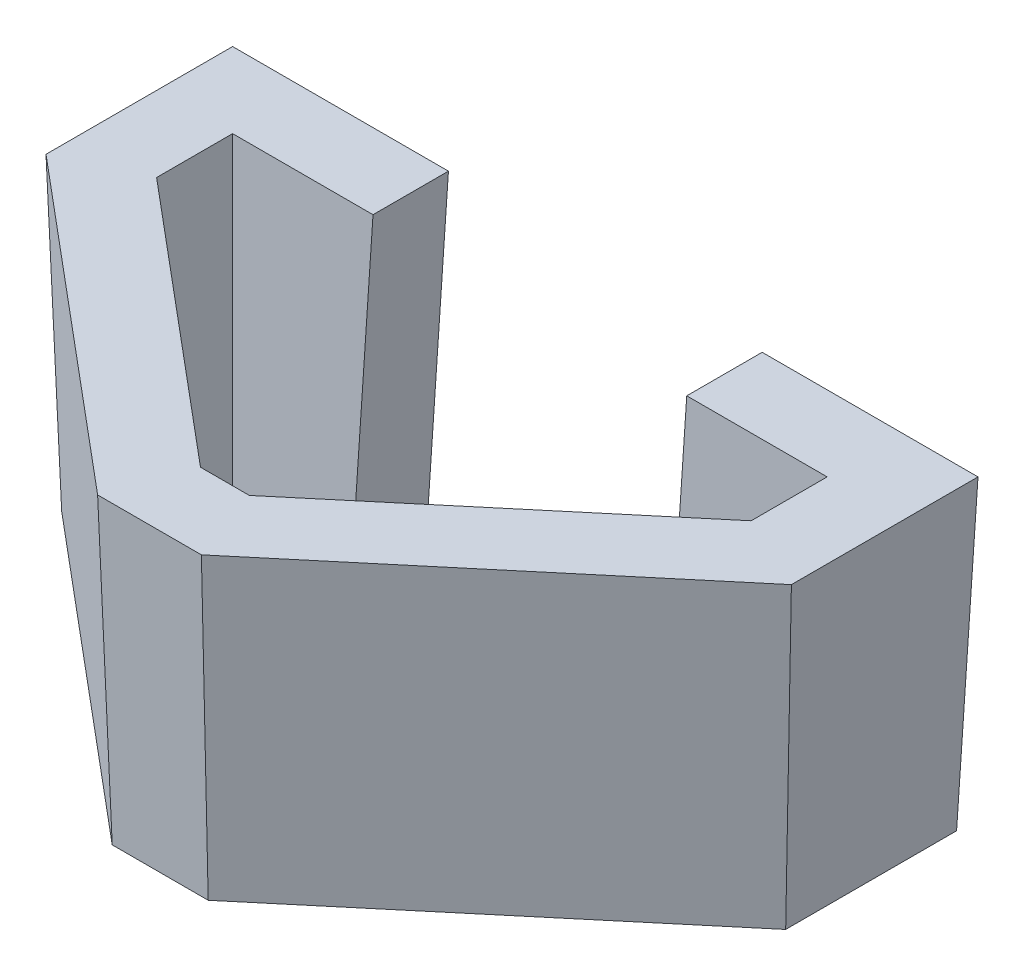
ISO-10303-21;
HEADER;
FILE_DESCRIPTION(('STEP AP214'),'2;1');
FILE_NAME('part.step','',(''),(''),'','','');
FILE_SCHEMA(('AUTOMOTIVE_DESIGN { 1 0 10303 214 1 1 1 1 }'));
ENDSEC;
DATA;
#1=APPLICATION_CONTEXT('core data for automotive mechanical design processes');
#2=APPLICATION_PROTOCOL_DEFINITION('international standard','automotive_design',2000,#1);
#3=PRODUCT_CONTEXT('',#1,'mechanical');
#4=PRODUCT('Part','Part','',(#3));
#5=PRODUCT_RELATED_PRODUCT_CATEGORY('part','',(#4));
#6=PRODUCT_DEFINITION_FORMATION('','',#4);
#7=PRODUCT_DEFINITION_CONTEXT('part definition',#1,'design');
#8=PRODUCT_DEFINITION('design','',#6,#7);
#9=PRODUCT_DEFINITION_SHAPE('','',#8);
#10=(LENGTH_UNIT() NAMED_UNIT(*) SI_UNIT(.MILLI.,.METRE.));
#11=(NAMED_UNIT(*) PLANE_ANGLE_UNIT() SI_UNIT($,.RADIAN.));
#12=(NAMED_UNIT(*) SI_UNIT($,.STERADIAN.) SOLID_ANGLE_UNIT());
#13=UNCERTAINTY_MEASURE_WITH_UNIT(LENGTH_MEASURE(1.E-05),#10,'distance_accuracy_value','');
#14=(GEOMETRIC_REPRESENTATION_CONTEXT(3) GLOBAL_UNCERTAINTY_ASSIGNED_CONTEXT((#13)) GLOBAL_UNIT_ASSIGNED_CONTEXT((#10,
#11,#12)) REPRESENTATION_CONTEXT('',''));
#15=CARTESIAN_POINT('',(0.,0.,0.));
#16=DIRECTION('',(0.,0.,1.));
#17=DIRECTION('',(1.,0.,0.));
#18=AXIS2_PLACEMENT_3D('',#15,#16,#17);
#19=CARTESIAN_POINT('',(-12.5,0.,-12.5));
#20=DIRECTION('',(0.,-0.034899496702501,-0.999390827019096));
#21=DIRECTION('',(0.,0.999390827019096,-0.034899496702501));
#22=AXIS2_PLACEMENT_3D('',#19,#20,#21);
#23=PLANE('',#22);
#24=DIRECTION('',(0.0348782627423747,0.998782765958718,-0.0348782627423747));
#25=VECTOR('',#24,1.);
#26=CARTESIAN_POINT('',(19.5316609536796,-5.56585547708475,-12.3056360438603));
#27=LINE('',#26,#25);
#28=CARTESIAN_POINT('',(19.7260249098192,0.,-12.5));
#29=VERTEX_POINT('',#28);
#30=CARTESIAN_POINT('',(21.5,50.8,-14.2739750901808));
#31=VERTEX_POINT('',#30);
#32=EDGE_CURVE('E146',#29,#31,#27,.T.);
#33=ORIENTED_EDGE('',*,*,#32,.F.);
#34=DIRECTION('',(-1.,0.,0.));
#35=VECTOR('',#34,1.);
#36=CARTESIAN_POINT('',(-12.5,0.,-12.5));
#37=LINE('',#36,#35);
#38=CARTESIAN_POINT('',(-12.5,0.,-12.5));
#39=VERTEX_POINT('',#38);
#40=EDGE_CURVE('E289',#29,#39,#37,.T.);
#41=ORIENTED_EDGE('',*,*,#40,.T.);
#42=DIRECTION('',(0.0348782627423747,-0.998782765958718,0.0348782627423747));
#43=VECTOR('',#42,1.);
#44=CARTESIAN_POINT('',(-12.4655381514715,-0.986858223060223,-12.4655381514715));
#45=LINE('',#44,#43);
#46=CARTESIAN_POINT('',(-14.2739750901808,50.8,-14.2739750901808));
#47=VERTEX_POINT('',#46);
#48=EDGE_CURVE('E166',#47,#39,#45,.T.);
#49=ORIENTED_EDGE('',*,*,#48,.F.);
#50=DIRECTION('',(1.,0.,0.));
#51=VECTOR('',#50,1.);
#52=CARTESIAN_POINT('',(0.,50.8,-14.2739750901808));
#53=LINE('',#52,#51);
#54=EDGE_CURVE('E159',#31,#47,#53,.F.);
#55=ORIENTED_EDGE('',*,*,#54,.F.);
#56=EDGE_LOOP('',(#33,#41,#49,#55));
#57=FACE_BOUND('',#56,.T.);
#58=ADVANCED_FACE('F36',(#57),#23,.T.);
#59=DIRECTION('',(0.0348782627423747,0.998782765958718,-0.0348782627423747));
#60=VECTOR('',#59,1.);
#61=CARTESIAN_POINT('',(71.5316609536796,-5.56585547708475,-12.3056360438603));
#62=LINE('',#61,#60);
#63=CARTESIAN_POINT('',(71.7260249098192,0.,-12.5));
#64=VERTEX_POINT('',#63);
#65=CARTESIAN_POINT('',(73.5,50.8,-14.2739750901808));
#66=VERTEX_POINT('',#65);
#67=EDGE_CURVE('E153',#64,#66,#62,.T.);
#68=ORIENTED_EDGE('',*,*,#67,.T.);
#69=CARTESIAN_POINT('',(109.273975090181,50.8,-14.2739750901808));
#70=VERTEX_POINT('',#69);
#71=EDGE_CURVE('E168',#70,#66,#53,.F.);
#72=ORIENTED_EDGE('',*,*,#71,.F.);
#73=DIRECTION('',(-0.0348782627423747,-0.998782765958718,0.0348782627423747));
#74=VECTOR('',#73,1.);
#75=CARTESIAN_POINT('',(107.354020814569,-4.18029692803967,-12.3540208145689));
#76=LINE('',#75,#74);
#77=CARTESIAN_POINT('',(107.5,0.,-12.5));
#78=VERTEX_POINT('',#77);
#79=EDGE_CURVE('E191',#70,#78,#76,.T.);
#80=ORIENTED_EDGE('',*,*,#79,.T.);
#81=EDGE_CURVE('E188',#78,#64,#37,.T.);
#82=ORIENTED_EDGE('',*,*,#81,.T.);
#83=EDGE_LOOP('',(#68,#72,#80,#82));
#84=FACE_BOUND('',#83,.T.);
#85=ADVANCED_FACE('F223',(#84),#23,.T.);
#86=CARTESIAN_POINT('',(0.,50.8,0.));
#87=DIRECTION('',(0.,-1.,0.));
#88=DIRECTION('',(0.,0.,-1.));
#89=AXIS2_PLACEMENT_3D('',#86,#87,#88);
#90=PLANE('',#89);
#91=DIRECTION('',(0.,0.,-1.));
#92=VECTOR('',#91,1.);
#93=CARTESIAN_POINT('',(21.5,50.8,-1.77397509018079));
#94=LINE('',#93,#92);
#95=CARTESIAN_POINT('',(21.5,50.8,-1.77397509018079));
#96=VERTEX_POINT('',#95);
#97=EDGE_CURVE('E58',#96,#31,#94,.T.);
#98=ORIENTED_EDGE('',*,*,#97,.T.);
#99=ORIENTED_EDGE('',*,*,#54,.T.);
#100=DIRECTION('',(0.,0.,-1.));
#101=VECTOR('',#100,1.);
#102=CARTESIAN_POINT('',(-14.2739750901808,50.8,0.));
#103=LINE('',#102,#101);
#104=CARTESIAN_POINT('',(-14.2739750901808,50.8,16.656063896865));
#105=VERTEX_POINT('',#104);
#106=EDGE_CURVE('E199',#47,#105,#103,.F.);
#107=ORIENTED_EDGE('',*,*,#106,.T.);
#108=DIRECTION('',(-0.766044443118982,0.,-0.642787609686535));
#109=VECTOR('',#108,1.);
#110=CARTESIAN_POINT('',(-14.0991730940035,50.8,16.8027401873865));
#111=LINE('',#110,#109);
#112=CARTESIAN_POINT('',(38.8995808685033,50.8,61.2739750901808));
#113=VERTEX_POINT('',#112);
#114=EDGE_CURVE('E201',#105,#113,#111,.F.);
#115=ORIENTED_EDGE('',*,*,#114,.T.);
#116=DIRECTION('',(-1.,0.,0.));
#117=VECTOR('',#116,1.);
#118=CARTESIAN_POINT('',(0.,50.8,61.2739750901808));
#119=LINE('',#118,#117);
#120=CARTESIAN_POINT('',(56.1004191314967,50.8,61.2739750901808));
#121=VERTEX_POINT('',#120);
#122=EDGE_CURVE('E203',#113,#121,#119,.F.);
#123=ORIENTED_EDGE('',*,*,#122,.T.);
#124=DIRECTION('',(-0.766044443118981,0.,0.642787609686535));
#125=VECTOR('',#124,1.);
#126=CARTESIAN_POINT('',(53.3508846548238,50.8,63.5811084554662));
#127=LINE('',#126,#125);
#128=CARTESIAN_POINT('',(109.273975090181,50.8,16.656063896865));
#129=VERTEX_POINT('',#128);
#130=EDGE_CURVE('E172',#121,#129,#127,.F.);
#131=ORIENTED_EDGE('',*,*,#130,.T.);
#132=DIRECTION('',(0.,0.,1.));
#133=VECTOR('',#132,1.);
#134=CARTESIAN_POINT('',(109.273975090181,50.8,0.));
#135=LINE('',#134,#133);
#136=EDGE_CURVE('E169',#129,#70,#135,.F.);
#137=ORIENTED_EDGE('',*,*,#136,.T.);
#138=ORIENTED_EDGE('',*,*,#71,.T.);
#139=DIRECTION('',(0.,0.,1.));
#140=VECTOR('',#139,1.);
#141=CARTESIAN_POINT('',(73.5,50.8,-14.2739750901808));
#142=LINE('',#141,#140);
#143=CARTESIAN_POINT('',(73.5,50.8,-1.77397509018078));
#144=VERTEX_POINT('',#143);
#145=EDGE_CURVE('E163',#66,#144,#142,.T.);
#146=ORIENTED_EDGE('',*,*,#145,.T.);
#147=DIRECTION('',(-1.,0.,0.));
#148=VECTOR('',#147,1.);
#149=CARTESIAN_POINT('',(96.7739750901808,50.8,-1.77397509018079));
#150=LINE('',#149,#148);
#151=CARTESIAN_POINT('',(96.7739750901808,50.8,-1.77397509018079));
#152=VERTEX_POINT('',#151);
#153=EDGE_CURVE('E227',#152,#144,#150,.T.);
#154=ORIENTED_EDGE('',*,*,#153,.F.);
#155=DIRECTION('',(0.,0.,-1.));
#156=VECTOR('',#155,1.);
#157=CARTESIAN_POINT('',(96.7739750901808,50.8,10.8272181699275));
#158=LINE('',#157,#156);
#159=CARTESIAN_POINT('',(96.7739750901808,50.8,10.8272181699275));
#160=VERTEX_POINT('',#159);
#161=EDGE_CURVE('E251',#160,#152,#158,.T.);
#162=ORIENTED_EDGE('',*,*,#161,.F.);
#163=DIRECTION('',(0.766044443118981,0.,-0.642787609686535));
#164=VECTOR('',#163,1.);
#165=CARTESIAN_POINT('',(51.5507912031692,50.8,48.7739750901808));
#166=LINE('',#165,#164);
#167=CARTESIAN_POINT('',(51.5507912031692,50.8,48.7739750901808));
#168=VERTEX_POINT('',#167);
#169=EDGE_CURVE('E248',#168,#160,#166,.T.);
#170=ORIENTED_EDGE('',*,*,#169,.F.);
#171=DIRECTION('',(1.,0.,0.));
#172=VECTOR('',#171,1.);
#173=CARTESIAN_POINT('',(43.4492087968308,50.8,48.7739750901808));
#174=LINE('',#173,#172);
#175=CARTESIAN_POINT('',(43.4492087968308,50.8,48.7739750901808));
#176=VERTEX_POINT('',#175);
#177=EDGE_CURVE('E245',#176,#168,#174,.T.);
#178=ORIENTED_EDGE('',*,*,#177,.F.);
#179=DIRECTION('',(0.766044443118982,0.,0.642787609686535));
#180=VECTOR('',#179,1.);
#181=CARTESIAN_POINT('',(-1.77397509018079,50.8,10.8272181699275));
#182=LINE('',#181,#180);
#183=CARTESIAN_POINT('',(-1.77397509018079,50.8,10.8272181699275));
#184=VERTEX_POINT('',#183);
#185=EDGE_CURVE('E238',#184,#176,#182,.T.);
#186=ORIENTED_EDGE('',*,*,#185,.F.);
#187=DIRECTION('',(0.,0.,1.));
#188=VECTOR('',#187,1.);
#189=CARTESIAN_POINT('',(-1.77397509018079,50.8,-1.77397509018079));
#190=LINE('',#189,#188);
#191=CARTESIAN_POINT('',(-1.77397509018079,50.8,-1.77397509018079));
#192=VERTEX_POINT('',#191);
#193=EDGE_CURVE('E235',#192,#184,#190,.T.);
#194=ORIENTED_EDGE('',*,*,#193,.F.);
#195=EDGE_CURVE('E162',#96,#192,#150,.T.);
#196=ORIENTED_EDGE('',*,*,#195,.F.);
#197=EDGE_LOOP('',(#98,#99,#107,#115,#123,#131,#137,#138,#146,#154,#162,#170,#178,#186,#194,#196));
#198=FACE_BOUND('',#197,.T.);
#199=ADVANCED_FACE('F157',(#198),#90,.F.);
#200=CARTESIAN_POINT('',(0.,0.,0.));
#201=DIRECTION('',(0.,-1.,0.));
#202=DIRECTION('',(0.,0.,-1.));
#203=AXIS2_PLACEMENT_3D('',#200,#201,#202);
#204=PLANE('',#203);
#205=ORIENTED_EDGE('',*,*,#40,.F.);
#206=DIRECTION('',(0.,0.,1.));
#207=VECTOR('',#206,1.);
#208=CARTESIAN_POINT('',(19.7260249098192,0.,0.));
#209=LINE('',#208,#207);
#210=CARTESIAN_POINT('',(19.7260249098192,0.,0.));
#211=VERTEX_POINT('',#210);
#212=EDGE_CURVE('E149',#29,#211,#209,.T.);
#213=ORIENTED_EDGE('',*,*,#212,.T.);
#214=DIRECTION('',(-1.,0.,0.));
#215=VECTOR('',#214,1.);
#216=CARTESIAN_POINT('',(0.,0.,0.));
#217=LINE('',#216,#215);
#218=CARTESIAN_POINT('',(0.,0.,0.));
#219=VERTEX_POINT('',#218);
#220=EDGE_CURVE('E253',#211,#219,#217,.T.);
#221=ORIENTED_EDGE('',*,*,#220,.T.);
#222=DIRECTION('',(0.,0.,1.));
#223=VECTOR('',#222,1.);
#224=CARTESIAN_POINT('',(0.,0.,0.));
#225=LINE('',#224,#223);
#226=CARTESIAN_POINT('',(0.,0.,9.99999999999999));
#227=VERTEX_POINT('',#226);
#228=EDGE_CURVE('E270',#219,#227,#225,.T.);
#229=ORIENTED_EDGE('',*,*,#228,.T.);
#230=DIRECTION('',(0.766044443118982,0.,0.642787609686535));
#231=VECTOR('',#230,1.);
#232=CARTESIAN_POINT('',(-4.92403876506103,0.,5.86824088833471));
#233=LINE('',#232,#231);
#234=CARTESIAN_POINT('',(44.0948829259863,0.,47.));
#235=VERTEX_POINT('',#234);
#236=EDGE_CURVE('E279',#227,#235,#233,.T.);
#237=ORIENTED_EDGE('',*,*,#236,.T.);
#238=DIRECTION('',(1.,0.,0.));
#239=VECTOR('',#238,1.);
#240=CARTESIAN_POINT('',(0.,0.,47.));
#241=LINE('',#240,#239);
#242=CARTESIAN_POINT('',(50.9051170740137,0.,47.));
#243=VERTEX_POINT('',#242);
#244=EDGE_CURVE('E276',#235,#243,#241,.T.);
#245=ORIENTED_EDGE('',*,*,#244,.T.);
#246=DIRECTION('',(0.766044443118981,0.,-0.642787609686535));
#247=VECTOR('',#246,1.);
#248=CARTESIAN_POINT('',(44.1757503258813,0.,52.6466091564145));
#249=LINE('',#248,#247);
#250=CARTESIAN_POINT('',(95.,0.,9.99999999999997));
#251=VERTEX_POINT('',#250);
#252=EDGE_CURVE('E273',#243,#251,#249,.T.);
#253=ORIENTED_EDGE('',*,*,#252,.T.);
#254=DIRECTION('',(0.,0.,-1.));
#255=VECTOR('',#254,1.);
#256=CARTESIAN_POINT('',(95.,0.,0.));
#257=LINE('',#256,#255);
#258=CARTESIAN_POINT('',(95.,0.,0.));
#259=VERTEX_POINT('',#258);
#260=EDGE_CURVE('E261',#251,#259,#257,.T.);
#261=ORIENTED_EDGE('',*,*,#260,.T.);
#262=CARTESIAN_POINT('',(71.7260249098192,0.,0.));
#263=VERTEX_POINT('',#262);
#264=EDGE_CURVE('E268',#259,#263,#217,.T.);
#265=ORIENTED_EDGE('',*,*,#264,.T.);
#266=DIRECTION('',(0.,0.,-1.));
#267=VECTOR('',#266,1.);
#268=CARTESIAN_POINT('',(71.7260249098192,0.,0.));
#269=LINE('',#268,#267);
#270=EDGE_CURVE('E51',#263,#64,#269,.T.);
#271=ORIENTED_EDGE('',*,*,#270,.T.);
#272=ORIENTED_EDGE('',*,*,#81,.F.);
#273=DIRECTION('',(0.,0.,-1.));
#274=VECTOR('',#273,1.);
#275=CARTESIAN_POINT('',(107.5,0.,-12.5));
#276=LINE('',#275,#274);
#277=CARTESIAN_POINT('',(107.5,0.,15.8288457269375));
#278=VERTEX_POINT('',#277);
#279=EDGE_CURVE('E218',#278,#78,#276,.T.);
#280=ORIENTED_EDGE('',*,*,#279,.F.);
#281=DIRECTION('',(0.766044443118981,0.,-0.642787609686535));
#282=VECTOR('',#281,1.);
#283=CARTESIAN_POINT('',(107.5,0.,15.8288457269375));
#284=LINE('',#283,#282);
#285=CARTESIAN_POINT('',(55.4547450023412,0.,59.5));
#286=VERTEX_POINT('',#285);
#287=EDGE_CURVE('E213',#286,#278,#284,.T.);
#288=ORIENTED_EDGE('',*,*,#287,.F.);
#289=DIRECTION('',(1.,0.,0.));
#290=VECTOR('',#289,1.);
#291=CARTESIAN_POINT('',(55.4547450023412,0.,59.5));
#292=LINE('',#291,#290);
#293=CARTESIAN_POINT('',(39.5452549976588,0.,59.5));
#294=VERTEX_POINT('',#293);
#295=EDGE_CURVE('E287',#294,#286,#292,.T.);
#296=ORIENTED_EDGE('',*,*,#295,.F.);
#297=DIRECTION('',(0.766044443118982,0.,0.642787609686535));
#298=VECTOR('',#297,1.);
#299=CARTESIAN_POINT('',(39.5452549976588,0.,59.5));
#300=LINE('',#299,#298);
#301=CARTESIAN_POINT('',(-12.5,0.,15.8288457269375));
#302=VERTEX_POINT('',#301);
#303=EDGE_CURVE('E285',#302,#294,#300,.T.);
#304=ORIENTED_EDGE('',*,*,#303,.F.);
#305=DIRECTION('',(0.,0.,1.));
#306=VECTOR('',#305,1.);
#307=CARTESIAN_POINT('',(-12.5,0.,15.8288457269375));
#308=LINE('',#307,#306);
#309=EDGE_CURVE('E255',#39,#302,#308,.T.);
#310=ORIENTED_EDGE('',*,*,#309,.F.);
#311=EDGE_LOOP('',(#205,#213,#221,#229,#237,#245,#253,#261,#265,#271,#272,#280,#288,#296,#304,#310));
#312=FACE_BOUND('',#311,.T.);
#313=ADVANCED_FACE('F291',(#312),#204,.T.);
#314=CARTESIAN_POINT('',(96.7739750901808,50.8,-1.77397509018079));
#315=DIRECTION('',(0.,-0.034899496702501,-0.999390827019096));
#316=DIRECTION('',(0.,0.999390827019096,-0.034899496702501));
#317=AXIS2_PLACEMENT_3D('',#314,#315,#316);
#318=PLANE('',#317);
#319=DIRECTION('',(-0.0348782627423747,-0.998782765958718,0.0348782627423747));
#320=VECTOR('',#319,1.);
#321=CARTESIAN_POINT('',(21.5915702797319,53.4222297235901,-1.86554536991269));
#322=LINE('',#321,#320);
#323=EDGE_CURVE('E11',#96,#211,#322,.T.);
#324=ORIENTED_EDGE('',*,*,#323,.F.);
#325=ORIENTED_EDGE('',*,*,#195,.T.);
#326=DIRECTION('',(-0.0348782627423747,0.998782765958718,-0.0348782627423747));
#327=VECTOR('',#326,1.);
#328=CARTESIAN_POINT('',(-1.65409217773714,47.3670025549702,-1.65409217773715));
#329=LINE('',#328,#327);
#330=EDGE_CURVE('E257',#219,#192,#329,.T.);
#331=ORIENTED_EDGE('',*,*,#330,.F.);
#332=ORIENTED_EDGE('',*,*,#220,.F.);
#333=EDGE_LOOP('',(#324,#325,#331,#332));
#334=FACE_BOUND('',#333,.T.);
#335=ADVANCED_FACE('F297',(#334),#318,.F.);
#336=DIRECTION('',(0.0348782627423747,0.998782765958718,-0.0348782627423747));
#337=VECTOR('',#336,1.);
#338=CARTESIAN_POINT('',(73.5283126327118,51.6107677214396,-1.80228772289253));
#339=LINE('',#338,#337);
#340=EDGE_CURVE('E44',#263,#144,#339,.T.);
#341=ORIENTED_EDGE('',*,*,#340,.F.);
#342=ORIENTED_EDGE('',*,*,#264,.F.);
#343=DIRECTION('',(0.0348782627423747,0.998782765958718,-0.0348782627423747));
#344=VECTOR('',#343,1.);
#345=CARTESIAN_POINT('',(96.7586458241177,50.3610272543761,-1.7586458241177));
#346=LINE('',#345,#344);
#347=EDGE_CURVE('E233',#259,#152,#346,.T.);
#348=ORIENTED_EDGE('',*,*,#347,.T.);
#349=ORIENTED_EDGE('',*,*,#153,.T.);
#350=EDGE_LOOP('',(#341,#342,#348,#349));
#351=FACE_BOUND('',#350,.T.);
#352=ADVANCED_FACE('F230',(#351),#318,.F.);
#353=CARTESIAN_POINT('',(-12.5,0.,15.8288457269375));
#354=DIRECTION('',(-0.999390827019096,-0.034899496702501,0.));
#355=DIRECTION('',(0.034899496702501,-0.999390827019096,0.));
#356=AXIS2_PLACEMENT_3D('',#353,#354,#355);
#357=PLANE('',#356);
#358=ORIENTED_EDGE('',*,*,#309,.T.);
#359=DIRECTION('',(0.034894876230547,-0.999258514013935,-0.016271748016675));
#360=VECTOR('',#359,1.);
#361=CARTESIAN_POINT('',(-12.4614234800568,-1.10468699586631,15.8108572002631));
#362=LINE('',#361,#360);
#363=EDGE_CURVE('E175',#105,#302,#362,.T.);
#364=ORIENTED_EDGE('',*,*,#363,.F.);
#365=ORIENTED_EDGE('',*,*,#106,.F.);
#366=ORIENTED_EDGE('',*,*,#48,.T.);
#367=EDGE_LOOP('',(#358,#364,#365,#366));
#368=FACE_BOUND('',#367,.T.);
#369=ADVANCED_FACE('F331',(#368),#357,.T.);
#370=CARTESIAN_POINT('',(39.5452549976588,0.,59.5));
#371=DIRECTION('',(-0.642396040842254,-0.034899496702501,0.765577789542062));
#372=DIRECTION('',(0.766044443118982,0.,0.642787609686535));
#373=AXIS2_PLACEMENT_3D('',#370,#371,#372);
#374=PLANE('',#373);
#375=ORIENTED_EDGE('',*,*,#303,.T.);
#376=DIRECTION('',(0.0127013533476481,-0.999310210716416,-0.0348966815191779));
#377=VECTOR('',#376,1.);
#378=CARTESIAN_POINT('',(39.54782158622,-0.201932666992896,59.4929483558831));
#379=LINE('',#378,#377);
#380=EDGE_CURVE('E178',#113,#294,#379,.T.);
#381=ORIENTED_EDGE('',*,*,#380,.F.);
#382=ORIENTED_EDGE('',*,*,#114,.F.);
#383=ORIENTED_EDGE('',*,*,#363,.T.);
#384=EDGE_LOOP('',(#375,#381,#382,#383));
#385=FACE_BOUND('',#384,.T.);
#386=ADVANCED_FACE('F38',(#385),#374,.T.);
#387=CARTESIAN_POINT('',(55.4547450023412,0.,59.5));
#388=DIRECTION('',(0.,-0.034899496702501,0.999390827019096));
#389=DIRECTION('',(0.,-0.999390827019096,-0.034899496702501));
#390=AXIS2_PLACEMENT_3D('',#387,#388,#389);
#391=PLANE('',#390);
#392=ORIENTED_EDGE('',*,*,#295,.T.);
#393=DIRECTION('',(-0.0127013533476481,-0.999310210716416,-0.0348966815191779));
#394=VECTOR('',#393,1.);
#395=CARTESIAN_POINT('',(55.4437845829993,-0.862337946382392,59.4698864953504));
#396=LINE('',#395,#394);
#397=EDGE_CURVE('E184',#121,#286,#396,.T.);
#398=ORIENTED_EDGE('',*,*,#397,.F.);
#399=ORIENTED_EDGE('',*,*,#122,.F.);
#400=ORIENTED_EDGE('',*,*,#380,.T.);
#401=EDGE_LOOP('',(#392,#398,#399,#400));
#402=FACE_BOUND('',#401,.T.);
#403=ADVANCED_FACE('F335',(#402),#391,.T.);
#404=CARTESIAN_POINT('',(107.5,0.,15.8288457269375));
#405=DIRECTION('',(0.642396040842254,-0.034899496702501,0.765577789542062));
#406=DIRECTION('',(0.766044443118981,0.,-0.642787609686535));
#407=AXIS2_PLACEMENT_3D('',#404,#405,#406);
#408=PLANE('',#407);
#409=ORIENTED_EDGE('',*,*,#287,.T.);
#410=DIRECTION('',(-0.0348948762305471,-0.999258514013935,-0.016271748016675));
#411=VECTOR('',#410,1.);
#412=CARTESIAN_POINT('',(107.483914863461,-0.460618044011029,15.8213451045871));
#413=LINE('',#412,#411);
#414=EDGE_CURVE('E194',#129,#278,#413,.T.);
#415=ORIENTED_EDGE('',*,*,#414,.F.);
#416=ORIENTED_EDGE('',*,*,#130,.F.);
#417=ORIENTED_EDGE('',*,*,#397,.T.);
#418=EDGE_LOOP('',(#409,#415,#416,#417));
#419=FACE_BOUND('',#418,.T.);
#420=ADVANCED_FACE('F211',(#419),#408,.T.);
#421=CARTESIAN_POINT('',(107.5,0.,-12.5));
#422=DIRECTION('',(0.999390827019096,-0.034899496702501,0.));
#423=DIRECTION('',(0.0348994967025011,0.999390827019096,0.));
#424=AXIS2_PLACEMENT_3D('',#421,#422,#423);
#425=PLANE('',#424);
#426=ORIENTED_EDGE('',*,*,#279,.T.);
#427=ORIENTED_EDGE('',*,*,#79,.F.);
#428=ORIENTED_EDGE('',*,*,#136,.F.);
#429=ORIENTED_EDGE('',*,*,#414,.T.);
#430=EDGE_LOOP('',(#426,#427,#428,#429));
#431=FACE_BOUND('',#430,.T.);
#432=ADVANCED_FACE('F216',(#431),#425,.T.);
#433=CARTESIAN_POINT('',(96.7739750901808,50.8,10.8272181699275));
#434=DIRECTION('',(0.999390827019096,-0.034899496702501,0.));
#435=DIRECTION('',(0.034899496702501,0.999390827019096,0.));
#436=AXIS2_PLACEMENT_3D('',#433,#434,#435);
#437=PLANE('',#436);
#438=ORIENTED_EDGE('',*,*,#161,.T.);
#439=ORIENTED_EDGE('',*,*,#347,.F.);
#440=ORIENTED_EDGE('',*,*,#260,.F.);
#441=DIRECTION('',(0.034894876230547,0.999258514013934,0.016271748016675));
#442=VECTOR('',#441,1.);
#443=CARTESIAN_POINT('',(96.7404551649697,49.8401149316321,10.8115875721008));
#444=LINE('',#443,#442);
#445=EDGE_CURVE('E256',#251,#160,#444,.T.);
#446=ORIENTED_EDGE('',*,*,#445,.T.);
#447=EDGE_LOOP('',(#438,#439,#440,#446));
#448=FACE_BOUND('',#447,.T.);
#449=ADVANCED_FACE('F315',(#448),#437,.F.);
#450=CARTESIAN_POINT('',(51.5507912031692,50.8,48.7739750901808));
#451=DIRECTION('',(0.642396040842254,-0.034899496702501,0.765577789542062));
#452=DIRECTION('',(0.766044443118981,0.,-0.642787609686535));
#453=AXIS2_PLACEMENT_3D('',#450,#451,#452);
#454=PLANE('',#453);
#455=ORIENTED_EDGE('',*,*,#169,.T.);
#456=ORIENTED_EDGE('',*,*,#445,.F.);
#457=ORIENTED_EDGE('',*,*,#252,.F.);
#458=DIRECTION('',(0.0127013533476481,0.999310210716416,0.0348966815191779));
#459=VECTOR('',#458,1.);
#460=CARTESIAN_POINT('',(51.5494842204359,50.697169919231,48.7703841846334));
#461=LINE('',#460,#459);
#462=EDGE_CURVE('E265',#243,#168,#461,.T.);
#463=ORIENTED_EDGE('',*,*,#462,.T.);
#464=EDGE_LOOP('',(#455,#456,#457,#463));
#465=FACE_BOUND('',#464,.T.);
#466=ADVANCED_FACE('F312',(#465),#454,.F.);
#467=CARTESIAN_POINT('',(43.4492087968308,50.8,48.7739750901808));
#468=DIRECTION('',(0.,-0.034899496702501,0.999390827019096));
#469=DIRECTION('',(0.,-0.999390827019096,-0.034899496702501));
#470=AXIS2_PLACEMENT_3D('',#467,#468,#469);
#471=PLANE('',#470);
#472=ORIENTED_EDGE('',*,*,#177,.T.);
#473=ORIENTED_EDGE('',*,*,#462,.F.);
#474=ORIENTED_EDGE('',*,*,#244,.F.);
#475=DIRECTION('',(-0.0127013533476481,0.999310210716416,0.0348966815191779));
#476=VECTOR('',#475,1.);
#477=CARTESIAN_POINT('',(43.4587325288098,50.0506969650979,48.7478088516195));
#478=LINE('',#477,#476);
#479=EDGE_CURVE('E263',#235,#176,#478,.T.);
#480=ORIENTED_EDGE('',*,*,#479,.T.);
#481=EDGE_LOOP('',(#472,#473,#474,#480));
#482=FACE_BOUND('',#481,.T.);
#483=ADVANCED_FACE('F308',(#482),#471,.F.);
#484=CARTESIAN_POINT('',(-1.77397509018079,50.8,10.8272181699275));
#485=DIRECTION('',(-0.642396040842254,-0.034899496702501,0.765577789542062));
#486=DIRECTION('',(0.766044443118982,0.,0.642787609686535));
#487=AXIS2_PLACEMENT_3D('',#484,#485,#486);
#488=PLANE('',#487);
#489=ORIENTED_EDGE('',*,*,#185,.T.);
#490=ORIENTED_EDGE('',*,*,#479,.F.);
#491=ORIENTED_EDGE('',*,*,#236,.F.);
#492=DIRECTION('',(-0.0348948762305471,0.999258514013935,0.016271748016675));
#493=VECTOR('',#492,1.);
#494=CARTESIAN_POINT('',(-1.76682012466993,50.5951085954005,10.823881754716));
#495=LINE('',#494,#493);
#496=EDGE_CURVE('E260',#227,#184,#495,.T.);
#497=ORIENTED_EDGE('',*,*,#496,.T.);
#498=EDGE_LOOP('',(#489,#490,#491,#497));
#499=FACE_BOUND('',#498,.T.);
#500=ADVANCED_FACE('F304',(#499),#488,.F.);
#501=CARTESIAN_POINT('',(-1.77397509018079,50.8,-1.77397509018079));
#502=DIRECTION('',(-0.999390827019096,-0.034899496702501,0.));
#503=DIRECTION('',(0.0348994967025011,-0.999390827019096,0.));
#504=AXIS2_PLACEMENT_3D('',#501,#502,#503);
#505=PLANE('',#504);
#506=ORIENTED_EDGE('',*,*,#193,.T.);
#507=ORIENTED_EDGE('',*,*,#496,.F.);
#508=ORIENTED_EDGE('',*,*,#228,.F.);
#509=ORIENTED_EDGE('',*,*,#330,.T.);
#510=EDGE_LOOP('',(#506,#507,#508,#509));
#511=FACE_BOUND('',#510,.T.);
#512=ADVANCED_FACE('F301',(#511),#505,.F.);
#513=CARTESIAN_POINT('',(71.5316609536796,-5.56585547708475,-12.3056360438603));
#514=DIRECTION('',(-0.999390827019096,0.0348994967025011,0.));
#515=DIRECTION('',(-0.0348994967025011,-0.999390827019096,0.));
#516=AXIS2_PLACEMENT_3D('',#513,#514,#515);
#517=PLANE('',#516);
#518=ORIENTED_EDGE('',*,*,#340,.T.);
#519=ORIENTED_EDGE('',*,*,#145,.F.);
#520=ORIENTED_EDGE('',*,*,#67,.F.);
#521=ORIENTED_EDGE('',*,*,#270,.F.);
#522=EDGE_LOOP('',(#518,#519,#520,#521));
#523=FACE_BOUND('',#522,.T.);
#524=ADVANCED_FACE('F357',(#523),#517,.T.);
#525=CARTESIAN_POINT('',(19.5316609536796,-5.56585547708475,0.194363956139656));
#526=DIRECTION('',(0.999390827019096,-0.0348994967025011,0.));
#527=DIRECTION('',(0.0348994967025011,0.999390827019096,0.));
#528=AXIS2_PLACEMENT_3D('',#525,#526,#527);
#529=PLANE('',#528);
#530=ORIENTED_EDGE('',*,*,#32,.T.);
#531=ORIENTED_EDGE('',*,*,#97,.F.);
#532=ORIENTED_EDGE('',*,*,#323,.T.);
#533=ORIENTED_EDGE('',*,*,#212,.F.);
#534=EDGE_LOOP('',(#530,#531,#532,#533));
#535=FACE_BOUND('',#534,.T.);
#536=ADVANCED_FACE('F147',(#535),#529,.T.);
#537=CLOSED_SHELL('',(#58,#85,#199,#313,#335,#352,#369,#386,#403,#420,#432,#449,#466,#483,#500,
#512,#524,#536));
#538=MANIFOLD_SOLID_BREP('B2',#537);
#539=ADVANCED_BREP_SHAPE_REPRESENTATION('',(#18,#538),#14);
#540=SHAPE_DEFINITION_REPRESENTATION(#9,#539);
ENDSEC;
END-ISO-10303-21;
